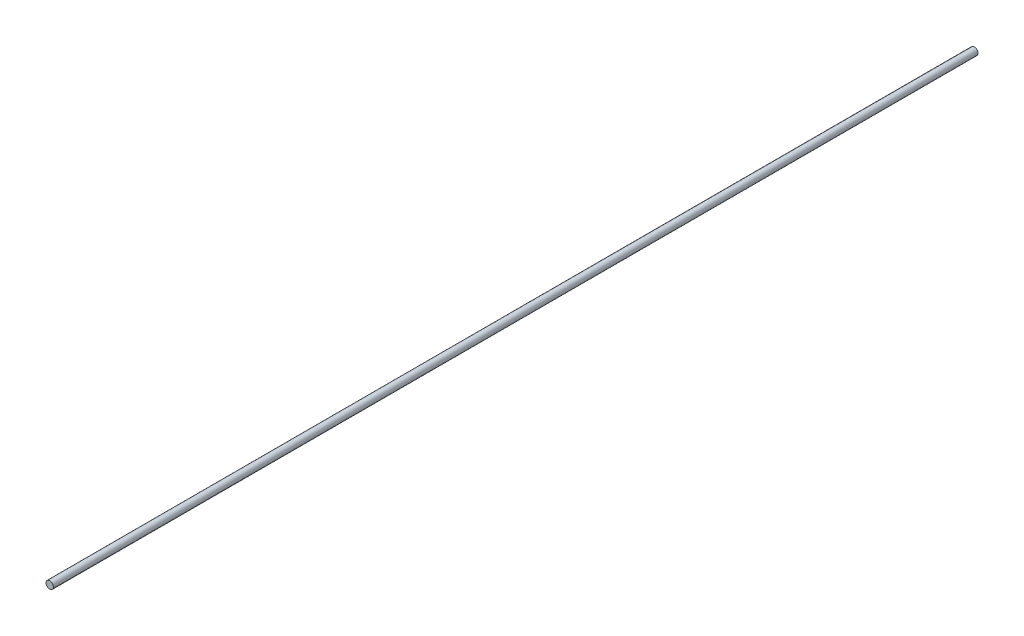
ISO-10303-21;
HEADER;
FILE_DESCRIPTION(('STEP AP214'),'2;1');
FILE_NAME('part.step','',(''),(''),'','','');
FILE_SCHEMA(('AUTOMOTIVE_DESIGN { 1 0 10303 214 1 1 1 1 }'));
ENDSEC;
DATA;
#1=APPLICATION_CONTEXT('core data for automotive mechanical design processes');
#2=APPLICATION_PROTOCOL_DEFINITION('international standard','automotive_design',2000,#1);
#3=PRODUCT_CONTEXT('',#1,'mechanical');
#4=PRODUCT('Part','Part','',(#3));
#5=PRODUCT_RELATED_PRODUCT_CATEGORY('part','',(#4));
#6=PRODUCT_DEFINITION_FORMATION('','',#4);
#7=PRODUCT_DEFINITION_CONTEXT('part definition',#1,'design');
#8=PRODUCT_DEFINITION('design','',#6,#7);
#9=PRODUCT_DEFINITION_SHAPE('','',#8);
#10=(LENGTH_UNIT() NAMED_UNIT(*) SI_UNIT(.MILLI.,.METRE.));
#11=(NAMED_UNIT(*) PLANE_ANGLE_UNIT() SI_UNIT($,.RADIAN.));
#12=(NAMED_UNIT(*) SI_UNIT($,.STERADIAN.) SOLID_ANGLE_UNIT());
#13=UNCERTAINTY_MEASURE_WITH_UNIT(LENGTH_MEASURE(1.E-05),#10,'distance_accuracy_value','');
#14=(GEOMETRIC_REPRESENTATION_CONTEXT(3) GLOBAL_UNCERTAINTY_ASSIGNED_CONTEXT((#13)) GLOBAL_UNIT_ASSIGNED_CONTEXT((#10,
#11,#12)) REPRESENTATION_CONTEXT('',''));
#15=CARTESIAN_POINT('',(0.,0.,0.));
#16=DIRECTION('',(0.,0.,1.));
#17=DIRECTION('',(1.,0.,0.));
#18=AXIS2_PLACEMENT_3D('',#15,#16,#17);
#19=CARTESIAN_POINT('',(0.,0.,0.));
#20=DIRECTION('',(0.,0.,1.));
#21=DIRECTION('',(1.,0.,0.));
#22=AXIS2_PLACEMENT_3D('',#19,#20,#21);
#23=PLANE('',#22);
#24=CARTESIAN_POINT('',(0.,0.,0.));
#25=DIRECTION('',(0.,0.,1.));
#26=DIRECTION('',(1.,0.,0.));
#27=AXIS2_PLACEMENT_3D('',#24,#25,#26);
#28=CIRCLE('',#27,0.975);
#29=CARTESIAN_POINT('',(0.975,0.,0.));
#30=VERTEX_POINT('',#29);
#31=EDGE_CURVE('E50',#30,#30,#28,.T.);
#32=ORIENTED_EDGE('',*,*,#31,.F.);
#33=EDGE_LOOP('',(#32));
#34=FACE_BOUND('',#33,.T.);
#35=DIRECTION('',(0.,1.,0.));
#36=VECTOR('',#35,1.);
#37=CARTESIAN_POINT('',(0.5,0.5,0.));
#38=LINE('',#37,#36);
#39=CARTESIAN_POINT('',(0.5,-0.5,0.));
#40=VERTEX_POINT('',#39);
#41=CARTESIAN_POINT('',(0.5,0.5,0.));
#42=VERTEX_POINT('',#41);
#43=EDGE_CURVE('E61',#40,#42,#38,.T.);
#44=ORIENTED_EDGE('',*,*,#43,.T.);
#45=DIRECTION('',(-1.,0.,0.));
#46=VECTOR('',#45,1.);
#47=CARTESIAN_POINT('',(-0.5,0.5,0.));
#48=LINE('',#47,#46);
#49=CARTESIAN_POINT('',(-0.5,0.5,0.));
#50=VERTEX_POINT('',#49);
#51=EDGE_CURVE('E116',#42,#50,#48,.T.);
#52=ORIENTED_EDGE('',*,*,#51,.T.);
#53=DIRECTION('',(0.,-1.,0.));
#54=VECTOR('',#53,1.);
#55=CARTESIAN_POINT('',(-0.5,0.5,0.));
#56=LINE('',#55,#54);
#57=CARTESIAN_POINT('',(-0.5,-0.5,0.));
#58=VERTEX_POINT('',#57);
#59=EDGE_CURVE('E106',#50,#58,#56,.T.);
#60=ORIENTED_EDGE('',*,*,#59,.T.);
#61=DIRECTION('',(1.,0.,0.));
#62=VECTOR('',#61,1.);
#63=CARTESIAN_POINT('',(-0.5,-0.5,0.));
#64=LINE('',#63,#62);
#65=EDGE_CURVE('E119',#58,#40,#64,.T.);
#66=ORIENTED_EDGE('',*,*,#65,.T.);
#67=EDGE_LOOP('',(#44,#52,#60,#66));
#68=FACE_BOUND('',#67,.T.);
#69=ADVANCED_FACE('F46',(#34,#68),#23,.F.);
#70=CARTESIAN_POINT('',(0.,0.,244.38));
#71=DIRECTION('',(0.,0.,-1.));
#72=DIRECTION('',(-1.,0.,0.));
#73=AXIS2_PLACEMENT_3D('',#70,#71,#72);
#74=CYLINDRICAL_SURFACE('',#73,0.975);
#75=CARTESIAN_POINT('',(0.,0.,244.38));
#76=DIRECTION('',(0.,0.,1.));
#77=DIRECTION('',(1.,0.,0.));
#78=AXIS2_PLACEMENT_3D('',#75,#76,#77);
#79=CIRCLE('',#78,0.975);
#80=CARTESIAN_POINT('',(0.975,0.,244.38));
#81=VERTEX_POINT('',#80);
#82=EDGE_CURVE('E11',#81,#81,#79,.T.);
#83=ORIENTED_EDGE('',*,*,#82,.F.);
#84=EDGE_LOOP('',(#83));
#85=FACE_BOUND('',#84,.T.);
#86=ORIENTED_EDGE('',*,*,#31,.T.);
#87=EDGE_LOOP('',(#86));
#88=FACE_BOUND('',#87,.T.);
#89=ADVANCED_FACE('F48',(#85,#88),#74,.T.);
#90=CARTESIAN_POINT('',(0.,0.,244.38));
#91=DIRECTION('',(0.,0.,1.));
#92=DIRECTION('',(1.,0.,0.));
#93=AXIS2_PLACEMENT_3D('',#90,#91,#92);
#94=PLANE('',#93);
#95=ORIENTED_EDGE('',*,*,#82,.T.);
#96=EDGE_LOOP('',(#95));
#97=FACE_BOUND('',#96,.T.);
#98=ADVANCED_FACE('F133',(#97),#94,.T.);
#99=CARTESIAN_POINT('',(0.5,0.5,5.));
#100=DIRECTION('',(-1.,0.,0.));
#101=DIRECTION('',(0.,0.,1.));
#102=AXIS2_PLACEMENT_3D('',#99,#100,#101);
#103=PLANE('',#102);
#104=ORIENTED_EDGE('',*,*,#43,.F.);
#105=DIRECTION('',(0.,0.,-1.));
#106=VECTOR('',#105,1.);
#107=CARTESIAN_POINT('',(0.5,-0.5,5.));
#108=LINE('',#107,#106);
#109=CARTESIAN_POINT('',(0.5,-0.5,5.));
#110=VERTEX_POINT('',#109);
#111=EDGE_CURVE('E111',#110,#40,#108,.T.);
#112=ORIENTED_EDGE('',*,*,#111,.F.);
#113=DIRECTION('',(0.,1.,0.));
#114=VECTOR('',#113,1.);
#115=CARTESIAN_POINT('',(0.5,0.5,5.));
#116=LINE('',#115,#114);
#117=CARTESIAN_POINT('',(0.5,0.5,5.));
#118=VERTEX_POINT('',#117);
#119=EDGE_CURVE('E102',#110,#118,#116,.T.);
#120=ORIENTED_EDGE('',*,*,#119,.T.);
#121=DIRECTION('',(0.,0.,-1.));
#122=VECTOR('',#121,1.);
#123=CARTESIAN_POINT('',(0.5,0.5,5.));
#124=LINE('',#123,#122);
#125=EDGE_CURVE('E100',#118,#42,#124,.T.);
#126=ORIENTED_EDGE('',*,*,#125,.T.);
#127=EDGE_LOOP('',(#104,#112,#120,#126));
#128=FACE_BOUND('',#127,.T.);
#129=ADVANCED_FACE('F131',(#128),#103,.T.);
#130=CARTESIAN_POINT('',(-0.5,0.5,5.));
#131=DIRECTION('',(0.,-1.,0.));
#132=DIRECTION('',(0.,0.,-1.));
#133=AXIS2_PLACEMENT_3D('',#130,#131,#132);
#134=PLANE('',#133);
#135=ORIENTED_EDGE('',*,*,#51,.F.);
#136=ORIENTED_EDGE('',*,*,#125,.F.);
#137=DIRECTION('',(-1.,0.,0.));
#138=VECTOR('',#137,1.);
#139=CARTESIAN_POINT('',(-0.5,0.5,5.));
#140=LINE('',#139,#138);
#141=CARTESIAN_POINT('',(-0.5,0.5,5.));
#142=VERTEX_POINT('',#141);
#143=EDGE_CURVE('E93',#118,#142,#140,.T.);
#144=ORIENTED_EDGE('',*,*,#143,.T.);
#145=DIRECTION('',(0.,0.,-1.));
#146=VECTOR('',#145,1.);
#147=CARTESIAN_POINT('',(-0.5,0.5,5.));
#148=LINE('',#147,#146);
#149=EDGE_CURVE('E99',#142,#50,#148,.T.);
#150=ORIENTED_EDGE('',*,*,#149,.T.);
#151=EDGE_LOOP('',(#135,#136,#144,#150));
#152=FACE_BOUND('',#151,.T.);
#153=ADVANCED_FACE('F98',(#152),#134,.T.);
#154=CARTESIAN_POINT('',(-0.5,0.5,5.));
#155=DIRECTION('',(1.,0.,0.));
#156=DIRECTION('',(0.,0.,-1.));
#157=AXIS2_PLACEMENT_3D('',#154,#155,#156);
#158=PLANE('',#157);
#159=ORIENTED_EDGE('',*,*,#59,.F.);
#160=ORIENTED_EDGE('',*,*,#149,.F.);
#161=DIRECTION('',(0.,-1.,0.));
#162=VECTOR('',#161,1.);
#163=CARTESIAN_POINT('',(-0.5,0.5,5.));
#164=LINE('',#163,#162);
#165=CARTESIAN_POINT('',(-0.5,-0.5,5.));
#166=VERTEX_POINT('',#165);
#167=EDGE_CURVE('E101',#142,#166,#164,.T.);
#168=ORIENTED_EDGE('',*,*,#167,.T.);
#169=DIRECTION('',(0.,0.,-1.));
#170=VECTOR('',#169,1.);
#171=CARTESIAN_POINT('',(-0.5,-0.5,5.));
#172=LINE('',#171,#170);
#173=EDGE_CURVE('E85',#166,#58,#172,.T.);
#174=ORIENTED_EDGE('',*,*,#173,.T.);
#175=EDGE_LOOP('',(#159,#160,#168,#174));
#176=FACE_BOUND('',#175,.T.);
#177=ADVANCED_FACE('F104',(#176),#158,.T.);
#178=CARTESIAN_POINT('',(-0.5,-0.5,5.));
#179=DIRECTION('',(0.,1.,0.));
#180=DIRECTION('',(0.,0.,1.));
#181=AXIS2_PLACEMENT_3D('',#178,#179,#180);
#182=PLANE('',#181);
#183=ORIENTED_EDGE('',*,*,#65,.F.);
#184=ORIENTED_EDGE('',*,*,#173,.F.);
#185=DIRECTION('',(1.,0.,0.));
#186=VECTOR('',#185,1.);
#187=CARTESIAN_POINT('',(-0.5,-0.5,5.));
#188=LINE('',#187,#186);
#189=EDGE_CURVE('E69',#166,#110,#188,.T.);
#190=ORIENTED_EDGE('',*,*,#189,.T.);
#191=ORIENTED_EDGE('',*,*,#111,.T.);
#192=EDGE_LOOP('',(#183,#184,#190,#191));
#193=FACE_BOUND('',#192,.T.);
#194=ADVANCED_FACE('F130',(#193),#182,.T.);
#195=CARTESIAN_POINT('',(0.,0.,5.));
#196=DIRECTION('',(0.,0.,1.));
#197=DIRECTION('',(1.,0.,0.));
#198=AXIS2_PLACEMENT_3D('',#195,#196,#197);
#199=PLANE('',#198);
#200=ORIENTED_EDGE('',*,*,#119,.F.);
#201=ORIENTED_EDGE('',*,*,#189,.F.);
#202=ORIENTED_EDGE('',*,*,#167,.F.);
#203=ORIENTED_EDGE('',*,*,#143,.F.);
#204=EDGE_LOOP('',(#200,#201,#202,#203));
#205=FACE_BOUND('',#204,.T.);
#206=ADVANCED_FACE('F109',(#205),#199,.F.);
#207=CLOSED_SHELL('',(#69,#89,#98,#129,#153,#177,#194,#206));
#208=MANIFOLD_SOLID_BREP('B2',#207);
#209=ADVANCED_BREP_SHAPE_REPRESENTATION('',(#18,#208),#14);
#210=SHAPE_DEFINITION_REPRESENTATION(#9,#209);
ENDSEC;
END-ISO-10303-21;
